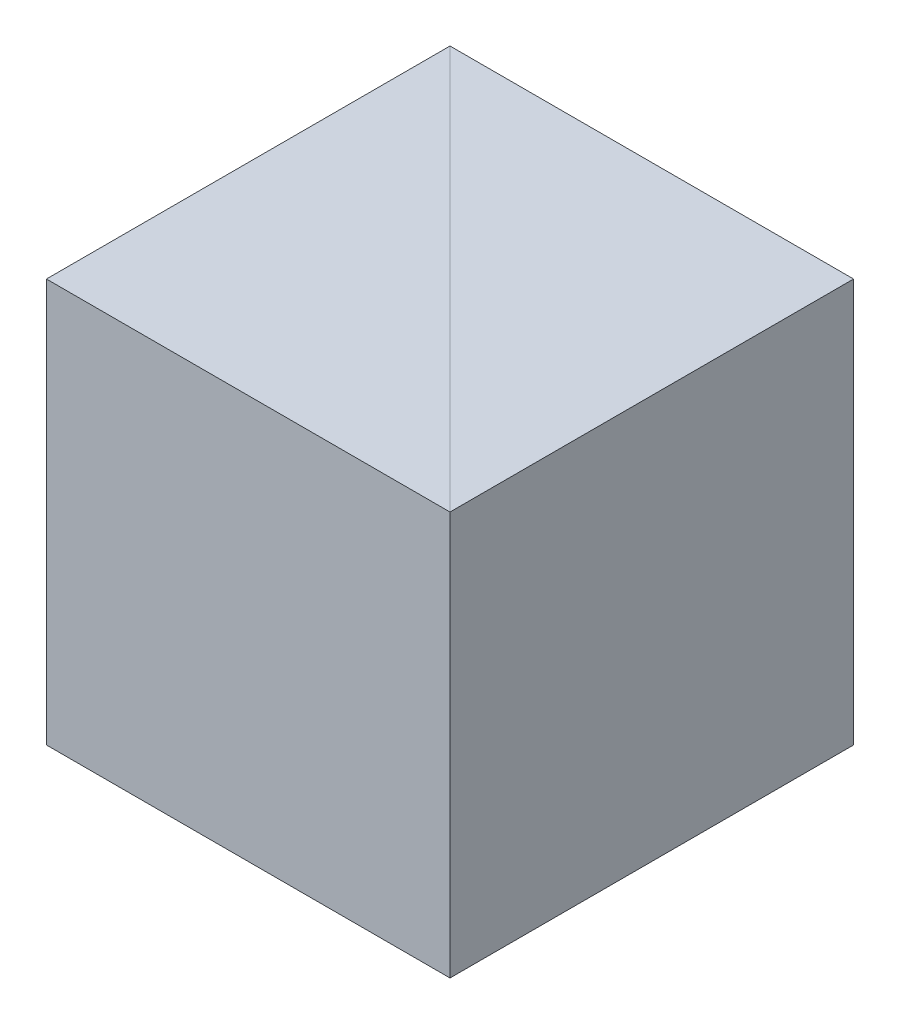
ISO-10303-21;
HEADER;
FILE_DESCRIPTION(('STEP AP214'),'2;1');
FILE_NAME('part.step','',(''),(''),'','','');
FILE_SCHEMA(('AUTOMOTIVE_DESIGN { 1 0 10303 214 1 1 1 1 }'));
ENDSEC;
DATA;
#1=APPLICATION_CONTEXT('core data for automotive mechanical design processes');
#2=APPLICATION_PROTOCOL_DEFINITION('international standard','automotive_design',2000,#1);
#3=PRODUCT_CONTEXT('',#1,'mechanical');
#4=PRODUCT('Part','Part','',(#3));
#5=PRODUCT_RELATED_PRODUCT_CATEGORY('part','',(#4));
#6=PRODUCT_DEFINITION_FORMATION('','',#4);
#7=PRODUCT_DEFINITION_CONTEXT('part definition',#1,'design');
#8=PRODUCT_DEFINITION('design','',#6,#7);
#9=PRODUCT_DEFINITION_SHAPE('','',#8);
#10=(LENGTH_UNIT() NAMED_UNIT(*) SI_UNIT(.MILLI.,.METRE.));
#11=(NAMED_UNIT(*) PLANE_ANGLE_UNIT() SI_UNIT($,.RADIAN.));
#12=(NAMED_UNIT(*) SI_UNIT($,.STERADIAN.) SOLID_ANGLE_UNIT());
#13=UNCERTAINTY_MEASURE_WITH_UNIT(LENGTH_MEASURE(1.E-05),#10,'distance_accuracy_value','');
#14=(GEOMETRIC_REPRESENTATION_CONTEXT(3) GLOBAL_UNCERTAINTY_ASSIGNED_CONTEXT((#13)) GLOBAL_UNIT_ASSIGNED_CONTEXT((#10,
#11,#12)) REPRESENTATION_CONTEXT('',''));
#15=CARTESIAN_POINT('',(0.,0.,0.));
#16=DIRECTION('',(0.,0.,1.));
#17=DIRECTION('',(1.,0.,0.));
#18=AXIS2_PLACEMENT_3D('',#15,#16,#17);
#19=CARTESIAN_POINT('',(0.,50.,0.));
#20=DIRECTION('',(0.707106781186547,0.,-0.707106781186548));
#21=DIRECTION('',(-0.707106781186548,0.,-0.707106781186547));
#22=AXIS2_PLACEMENT_3D('',#19,#20,#21);
#23=PLANE('',#22);
#24=DIRECTION('',(0.707106781186548,0.,0.707106781186547));
#25=VECTOR('',#24,1.);
#26=CARTESIAN_POINT('',(0.,0.,0.));
#27=LINE('',#26,#25);
#28=CARTESIAN_POINT('',(-50.,0.,-50.));
#29=VERTEX_POINT('',#28);
#30=CARTESIAN_POINT('',(0.,0.,0.));
#31=VERTEX_POINT('',#30);
#32=EDGE_CURVE('E99',#29,#31,#27,.T.);
#33=ORIENTED_EDGE('',*,*,#32,.F.);
#34=DIRECTION('',(0.,-1.,0.));
#35=VECTOR('',#34,1.);
#36=CARTESIAN_POINT('',(-50.,50.,-50.));
#37=LINE('',#36,#35);
#38=CARTESIAN_POINT('',(-50.,50.,-50.));
#39=VERTEX_POINT('',#38);
#40=EDGE_CURVE('E12',#39,#29,#37,.T.);
#41=ORIENTED_EDGE('',*,*,#40,.F.);
#42=DIRECTION('',(0.707106781186548,0.,0.707106781186547));
#43=VECTOR('',#42,1.);
#44=CARTESIAN_POINT('',(0.,50.,0.));
#45=LINE('',#44,#43);
#46=CARTESIAN_POINT('',(0.,50.,0.));
#47=VERTEX_POINT('',#46);
#48=EDGE_CURVE('E91',#39,#47,#45,.T.);
#49=ORIENTED_EDGE('',*,*,#48,.T.);
#50=DIRECTION('',(0.,-1.,0.));
#51=VECTOR('',#50,1.);
#52=CARTESIAN_POINT('',(0.,50.,0.));
#53=LINE('',#52,#51);
#54=EDGE_CURVE('E50',#47,#31,#53,.T.);
#55=ORIENTED_EDGE('',*,*,#54,.T.);
#56=EDGE_LOOP('',(#33,#41,#49,#55));
#57=FACE_BOUND('',#56,.T.);
#58=ADVANCED_FACE('F47',(#57),#23,.T.);
#59=CARTESIAN_POINT('',(-50.,50.,-50.));
#60=DIRECTION('',(-1.,0.,0.));
#61=DIRECTION('',(0.,0.,1.));
#62=AXIS2_PLACEMENT_3D('',#59,#60,#61);
#63=PLANE('',#62);
#64=DIRECTION('',(0.,0.,-1.));
#65=VECTOR('',#64,1.);
#66=CARTESIAN_POINT('',(-50.,0.,-50.));
#67=LINE('',#66,#65);
#68=CARTESIAN_POINT('',(-50.,0.,0.));
#69=VERTEX_POINT('',#68);
#70=EDGE_CURVE('E93',#69,#29,#67,.T.);
#71=ORIENTED_EDGE('',*,*,#70,.F.);
#72=DIRECTION('',(0.,-1.,0.));
#73=VECTOR('',#72,1.);
#74=CARTESIAN_POINT('',(-50.,50.,0.));
#75=LINE('',#74,#73);
#76=CARTESIAN_POINT('',(-50.,50.,0.));
#77=VERTEX_POINT('',#76);
#78=EDGE_CURVE('E56',#77,#69,#75,.T.);
#79=ORIENTED_EDGE('',*,*,#78,.F.);
#80=DIRECTION('',(0.,0.,-1.));
#81=VECTOR('',#80,1.);
#82=CARTESIAN_POINT('',(-50.,50.,-50.));
#83=LINE('',#82,#81);
#84=EDGE_CURVE('E88',#77,#39,#83,.T.);
#85=ORIENTED_EDGE('',*,*,#84,.T.);
#86=ORIENTED_EDGE('',*,*,#40,.T.);
#87=EDGE_LOOP('',(#71,#79,#85,#86));
#88=FACE_BOUND('',#87,.T.);
#89=ADVANCED_FACE('F103',(#88),#63,.T.);
#90=CARTESIAN_POINT('',(-50.,50.,0.));
#91=DIRECTION('',(0.,0.,1.));
#92=DIRECTION('',(1.,0.,0.));
#93=AXIS2_PLACEMENT_3D('',#90,#91,#92);
#94=PLANE('',#93);
#95=DIRECTION('',(-1.,0.,0.));
#96=VECTOR('',#95,1.);
#97=CARTESIAN_POINT('',(-50.,0.,0.));
#98=LINE('',#97,#96);
#99=EDGE_CURVE('E86',#31,#69,#98,.T.);
#100=ORIENTED_EDGE('',*,*,#99,.F.);
#101=ORIENTED_EDGE('',*,*,#54,.F.);
#102=DIRECTION('',(-1.,0.,0.));
#103=VECTOR('',#102,1.);
#104=CARTESIAN_POINT('',(-50.,50.,0.));
#105=LINE('',#104,#103);
#106=EDGE_CURVE('E84',#47,#77,#105,.T.);
#107=ORIENTED_EDGE('',*,*,#106,.T.);
#108=ORIENTED_EDGE('',*,*,#78,.T.);
#109=EDGE_LOOP('',(#100,#101,#107,#108));
#110=FACE_BOUND('',#109,.T.);
#111=ADVANCED_FACE('F83',(#110),#94,.T.);
#112=CARTESIAN_POINT('',(0.,50.,0.));
#113=DIRECTION('',(0.,1.,0.));
#114=DIRECTION('',(0.,0.,1.));
#115=AXIS2_PLACEMENT_3D('',#112,#113,#114);
#116=PLANE('',#115);
#117=ORIENTED_EDGE('',*,*,#48,.F.);
#118=ORIENTED_EDGE('',*,*,#84,.F.);
#119=ORIENTED_EDGE('',*,*,#106,.F.);
#120=EDGE_LOOP('',(#117,#118,#119));
#121=FACE_BOUND('',#120,.T.);
#122=ADVANCED_FACE('F90',(#121),#116,.T.);
#123=CARTESIAN_POINT('',(0.,0.,0.));
#124=DIRECTION('',(0.,1.,0.));
#125=DIRECTION('',(0.,0.,1.));
#126=AXIS2_PLACEMENT_3D('',#123,#124,#125);
#127=PLANE('',#126);
#128=ORIENTED_EDGE('',*,*,#32,.T.);
#129=ORIENTED_EDGE('',*,*,#99,.T.);
#130=ORIENTED_EDGE('',*,*,#70,.T.);
#131=EDGE_LOOP('',(#128,#129,#130));
#132=FACE_BOUND('',#131,.T.);
#133=ADVANCED_FACE('F102',(#132),#127,.F.);
#134=CLOSED_SHELL('',(#58,#89,#111,#122,#133));
#135=MANIFOLD_SOLID_BREP('B2',#134);
#136=CARTESIAN_POINT('',(-50.,50.,-50.));
#137=DIRECTION('',(0.707106781186547,0.,-0.707106781186548));
#138=DIRECTION('',(-0.707106781186548,0.,-0.707106781186547));
#139=AXIS2_PLACEMENT_3D('',#136,#137,#138);
#140=PLANE('',#139);
#141=DIRECTION('',(0.707106781186548,0.,0.707106781186547));
#142=VECTOR('',#141,1.);
#143=CARTESIAN_POINT('',(-50.,0.,-50.));
#144=LINE('',#143,#142);
#145=CARTESIAN_POINT('',(-50.,0.,-50.));
#146=VERTEX_POINT('',#145);
#147=CARTESIAN_POINT('',(0.,0.,0.));
#148=VERTEX_POINT('',#147);
#149=EDGE_CURVE('E192',#146,#148,#144,.T.);
#150=ORIENTED_EDGE('',*,*,#149,.T.);
#151=DIRECTION('',(0.,-1.,0.));
#152=VECTOR('',#151,1.);
#153=CARTESIAN_POINT('',(0.,50.,0.));
#154=LINE('',#153,#152);
#155=CARTESIAN_POINT('',(0.,50.,0.));
#156=VERTEX_POINT('',#155);
#157=EDGE_CURVE('E45',#156,#148,#154,.T.);
#158=ORIENTED_EDGE('',*,*,#157,.F.);
#159=DIRECTION('',(0.707106781186548,0.,0.707106781186547));
#160=VECTOR('',#159,1.);
#161=CARTESIAN_POINT('',(-50.,50.,-50.));
#162=LINE('',#161,#160);
#163=CARTESIAN_POINT('',(-50.,50.,-50.));
#164=VERTEX_POINT('',#163);
#165=EDGE_CURVE('E185',#164,#156,#162,.T.);
#166=ORIENTED_EDGE('',*,*,#165,.F.);
#167=DIRECTION('',(0.,-1.,0.));
#168=VECTOR('',#167,1.);
#169=CARTESIAN_POINT('',(-50.,50.,-50.));
#170=LINE('',#169,#168);
#171=EDGE_CURVE('E193',#164,#146,#170,.T.);
#172=ORIENTED_EDGE('',*,*,#171,.T.);
#173=EDGE_LOOP('',(#150,#158,#166,#172));
#174=FACE_BOUND('',#173,.T.);
#175=ADVANCED_FACE('F145',(#174),#140,.F.);
#176=CARTESIAN_POINT('',(0.,50.,0.));
#177=DIRECTION('',(-1.,0.,0.));
#178=DIRECTION('',(0.,0.,1.));
#179=AXIS2_PLACEMENT_3D('',#176,#177,#178);
#180=PLANE('',#179);
#181=DIRECTION('',(0.,0.,-1.));
#182=VECTOR('',#181,1.);
#183=CARTESIAN_POINT('',(0.,0.,0.));
#184=LINE('',#183,#182);
#185=CARTESIAN_POINT('',(0.,0.,-50.));
#186=VERTEX_POINT('',#185);
#187=EDGE_CURVE('E173',#148,#186,#184,.T.);
#188=ORIENTED_EDGE('',*,*,#187,.T.);
#189=DIRECTION('',(0.,-1.,0.));
#190=VECTOR('',#189,1.);
#191=CARTESIAN_POINT('',(0.,50.,-50.));
#192=LINE('',#191,#190);
#193=CARTESIAN_POINT('',(0.,50.,-50.));
#194=VERTEX_POINT('',#193);
#195=EDGE_CURVE('E153',#194,#186,#192,.T.);
#196=ORIENTED_EDGE('',*,*,#195,.F.);
#197=DIRECTION('',(0.,0.,-1.));
#198=VECTOR('',#197,1.);
#199=CARTESIAN_POINT('',(0.,50.,0.));
#200=LINE('',#199,#198);
#201=EDGE_CURVE('E181',#156,#194,#200,.T.);
#202=ORIENTED_EDGE('',*,*,#201,.F.);
#203=ORIENTED_EDGE('',*,*,#157,.T.);
#204=EDGE_LOOP('',(#188,#196,#202,#203));
#205=FACE_BOUND('',#204,.T.);
#206=ADVANCED_FACE('F182',(#205),#180,.F.);
#207=CARTESIAN_POINT('',(0.,50.,-50.));
#208=DIRECTION('',(0.,0.,1.));
#209=DIRECTION('',(1.,0.,0.));
#210=AXIS2_PLACEMENT_3D('',#207,#208,#209);
#211=PLANE('',#210);
#212=DIRECTION('',(-1.,0.,0.));
#213=VECTOR('',#212,1.);
#214=CARTESIAN_POINT('',(0.,0.,-50.));
#215=LINE('',#214,#213);
#216=EDGE_CURVE('E178',#186,#146,#215,.T.);
#217=ORIENTED_EDGE('',*,*,#216,.T.);
#218=ORIENTED_EDGE('',*,*,#171,.F.);
#219=DIRECTION('',(-1.,0.,0.));
#220=VECTOR('',#219,1.);
#221=CARTESIAN_POINT('',(0.,50.,-50.));
#222=LINE('',#221,#220);
#223=EDGE_CURVE('E161',#194,#164,#222,.T.);
#224=ORIENTED_EDGE('',*,*,#223,.F.);
#225=ORIENTED_EDGE('',*,*,#195,.T.);
#226=EDGE_LOOP('',(#217,#218,#224,#225));
#227=FACE_BOUND('',#226,.T.);
#228=ADVANCED_FACE('F200',(#227),#211,.F.);
#229=CARTESIAN_POINT('',(0.,50.,0.));
#230=DIRECTION('',(0.,1.,0.));
#231=DIRECTION('',(0.,0.,1.));
#232=AXIS2_PLACEMENT_3D('',#229,#230,#231);
#233=PLANE('',#232);
#234=ORIENTED_EDGE('',*,*,#165,.T.);
#235=ORIENTED_EDGE('',*,*,#201,.T.);
#236=ORIENTED_EDGE('',*,*,#223,.T.);
#237=EDGE_LOOP('',(#234,#235,#236));
#238=FACE_BOUND('',#237,.T.);
#239=ADVANCED_FACE('F188',(#238),#233,.T.);
#240=CARTESIAN_POINT('',(0.,0.,0.));
#241=DIRECTION('',(0.,1.,0.));
#242=DIRECTION('',(0.,0.,1.));
#243=AXIS2_PLACEMENT_3D('',#240,#241,#242);
#244=PLANE('',#243);
#245=ORIENTED_EDGE('',*,*,#149,.F.);
#246=ORIENTED_EDGE('',*,*,#216,.F.);
#247=ORIENTED_EDGE('',*,*,#187,.F.);
#248=EDGE_LOOP('',(#245,#246,#247));
#249=FACE_BOUND('',#248,.T.);
#250=ADVANCED_FACE('F201',(#249),#244,.F.);
#251=CLOSED_SHELL('',(#175,#206,#228,#239,#250));
#252=MANIFOLD_SOLID_BREP('B6',#251);
#253=ADVANCED_BREP_SHAPE_REPRESENTATION('',(#18,#135,#252),#14);
#254=SHAPE_DEFINITION_REPRESENTATION(#9,#253);
ENDSEC;
END-ISO-10303-21;
